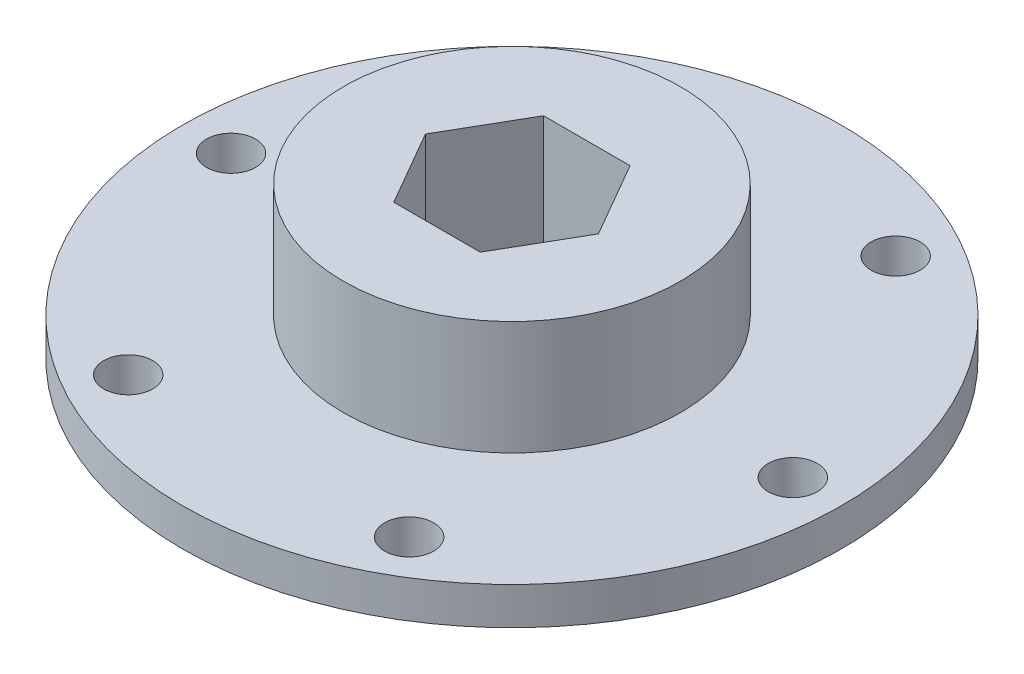
ISO-10303-21;
HEADER;
FILE_DESCRIPTION(('STEP AP214'),'2;1');
FILE_NAME('part.step','',(''),(''),'','','');
FILE_SCHEMA(('AUTOMOTIVE_DESIGN { 1 0 10303 214 1 1 1 1 }'));
ENDSEC;
DATA;
#1=APPLICATION_CONTEXT('core data for automotive mechanical design processes');
#2=APPLICATION_PROTOCOL_DEFINITION('international standard','automotive_design',2000,#1);
#3=PRODUCT_CONTEXT('',#1,'mechanical');
#4=PRODUCT('Part','Part','',(#3));
#5=PRODUCT_RELATED_PRODUCT_CATEGORY('part','',(#4));
#6=PRODUCT_DEFINITION_FORMATION('','',#4);
#7=PRODUCT_DEFINITION_CONTEXT('part definition',#1,'design');
#8=PRODUCT_DEFINITION('design','',#6,#7);
#9=PRODUCT_DEFINITION_SHAPE('','',#8);
#10=(LENGTH_UNIT() NAMED_UNIT(*) SI_UNIT(.MILLI.,.METRE.));
#11=(NAMED_UNIT(*) PLANE_ANGLE_UNIT() SI_UNIT($,.RADIAN.));
#12=(NAMED_UNIT(*) SI_UNIT($,.STERADIAN.) SOLID_ANGLE_UNIT());
#13=UNCERTAINTY_MEASURE_WITH_UNIT(LENGTH_MEASURE(1.E-05),#10,'distance_accuracy_value','');
#14=(GEOMETRIC_REPRESENTATION_CONTEXT(3) GLOBAL_UNCERTAINTY_ASSIGNED_CONTEXT((#13)) GLOBAL_UNIT_ASSIGNED_CONTEXT((#10,
#11,#12)) REPRESENTATION_CONTEXT('',''));
#15=CARTESIAN_POINT('',(0.,0.,0.));
#16=DIRECTION('',(0.,0.,1.));
#17=DIRECTION('',(1.,0.,0.));
#18=AXIS2_PLACEMENT_3D('',#15,#16,#17);
#19=CARTESIAN_POINT('',(0.,3.175,0.));
#20=DIRECTION('',(0.,-1.,0.));
#21=DIRECTION('',(0.,0.,-1.));
#22=AXIS2_PLACEMENT_3D('',#19,#20,#21);
#23=CYLINDRICAL_SURFACE('',#22,27.94);
#24=CARTESIAN_POINT('',(0.,3.175,0.));
#25=DIRECTION('',(0.,1.,0.));
#26=DIRECTION('',(0.,0.,1.));
#27=AXIS2_PLACEMENT_3D('',#24,#25,#26);
#28=CIRCLE('',#27,27.94);
#29=CARTESIAN_POINT('',(0.,3.175,27.94));
#30=VERTEX_POINT('',#29);
#31=EDGE_CURVE('E11',#30,#30,#28,.T.);
#32=ORIENTED_EDGE('',*,*,#31,.F.);
#33=EDGE_LOOP('',(#32));
#34=FACE_BOUND('',#33,.T.);
#35=CARTESIAN_POINT('',(0.,0.,0.));
#36=DIRECTION('',(0.,1.,0.));
#37=DIRECTION('',(0.,0.,1.));
#38=AXIS2_PLACEMENT_3D('',#35,#36,#37);
#39=CIRCLE('',#38,27.94);
#40=CARTESIAN_POINT('',(0.,0.,27.94));
#41=VERTEX_POINT('',#40);
#42=EDGE_CURVE('E37',#41,#41,#39,.T.);
#43=ORIENTED_EDGE('',*,*,#42,.T.);
#44=EDGE_LOOP('',(#43));
#45=FACE_BOUND('',#44,.T.);
#46=ADVANCED_FACE('F34',(#34,#45),#23,.T.);
#47=CARTESIAN_POINT('',(0.,3.175,0.));
#48=DIRECTION('',(0.,1.,0.));
#49=DIRECTION('',(0.,0.,1.));
#50=AXIS2_PLACEMENT_3D('',#47,#48,#49);
#51=PLANE('',#50);
#52=CARTESIAN_POINT('',(-23.8125,3.175,0.));
#53=DIRECTION('',(0.,1.,0.));
#54=DIRECTION('',(0.,0.,1.));
#55=AXIS2_PLACEMENT_3D('',#52,#53,#54);
#56=CIRCLE('',#55,2.0828);
#57=CARTESIAN_POINT('',(-23.8125,3.175,2.0828));
#58=VERTEX_POINT('',#57);
#59=EDGE_CURVE('E222',#58,#58,#56,.T.);
#60=ORIENTED_EDGE('',*,*,#59,.F.);
#61=EDGE_LOOP('',(#60));
#62=FACE_BOUND('',#61,.T.);
#63=CARTESIAN_POINT('',(-11.90625,3.175,-20.6222299276169));
#64=DIRECTION('',(0.,1.,0.));
#65=DIRECTION('',(0.,0.,1.));
#66=AXIS2_PLACEMENT_3D('',#63,#64,#65);
#67=CIRCLE('',#66,2.0828);
#68=CARTESIAN_POINT('',(-11.90625,3.175,-18.5394299276169));
#69=VERTEX_POINT('',#68);
#70=EDGE_CURVE('E231',#69,#69,#67,.T.);
#71=ORIENTED_EDGE('',*,*,#70,.F.);
#72=EDGE_LOOP('',(#71));
#73=FACE_BOUND('',#72,.T.);
#74=CARTESIAN_POINT('',(11.90625,3.175,-20.6222299276169));
#75=DIRECTION('',(0.,1.,0.));
#76=DIRECTION('',(0.,0.,1.));
#77=AXIS2_PLACEMENT_3D('',#74,#75,#76);
#78=CIRCLE('',#77,2.0828);
#79=CARTESIAN_POINT('',(11.90625,3.175,-18.539429927617));
#80=VERTEX_POINT('',#79);
#81=EDGE_CURVE('E237',#80,#80,#78,.T.);
#82=ORIENTED_EDGE('',*,*,#81,.F.);
#83=EDGE_LOOP('',(#82));
#84=FACE_BOUND('',#83,.T.);
#85=CARTESIAN_POINT('',(23.8125,3.175,0.));
#86=DIRECTION('',(0.,1.,0.));
#87=DIRECTION('',(0.,0.,1.));
#88=AXIS2_PLACEMENT_3D('',#85,#86,#87);
#89=CIRCLE('',#88,2.0828);
#90=CARTESIAN_POINT('',(23.8125,3.175,2.08279999999999));
#91=VERTEX_POINT('',#90);
#92=EDGE_CURVE('E243',#91,#91,#89,.T.);
#93=ORIENTED_EDGE('',*,*,#92,.F.);
#94=EDGE_LOOP('',(#93));
#95=FACE_BOUND('',#94,.T.);
#96=CARTESIAN_POINT('',(11.90625,3.175,20.6222299276169));
#97=DIRECTION('',(0.,1.,0.));
#98=DIRECTION('',(0.,0.,1.));
#99=AXIS2_PLACEMENT_3D('',#96,#97,#98);
#100=CIRCLE('',#99,2.0828);
#101=CARTESIAN_POINT('',(11.90625,3.175,22.7050299276169));
#102=VERTEX_POINT('',#101);
#103=EDGE_CURVE('E249',#102,#102,#100,.T.);
#104=ORIENTED_EDGE('',*,*,#103,.F.);
#105=EDGE_LOOP('',(#104));
#106=FACE_BOUND('',#105,.T.);
#107=CARTESIAN_POINT('',(-11.90625,3.175,20.622229927617));
#108=DIRECTION('',(0.,1.,0.));
#109=DIRECTION('',(0.,0.,1.));
#110=AXIS2_PLACEMENT_3D('',#107,#108,#109);
#111=CIRCLE('',#110,2.0828);
#112=CARTESIAN_POINT('',(-11.90625,3.175,22.705029927617));
#113=VERTEX_POINT('',#112);
#114=EDGE_CURVE('E111',#113,#113,#111,.T.);
#115=ORIENTED_EDGE('',*,*,#114,.F.);
#116=EDGE_LOOP('',(#115));
#117=FACE_BOUND('',#116,.T.);
#118=CARTESIAN_POINT('',(0.,3.175,0.));
#119=DIRECTION('',(0.,1.,0.));
#120=DIRECTION('',(0.,0.,1.));
#121=AXIS2_PLACEMENT_3D('',#118,#119,#120);
#122=CIRCLE('',#121,14.2875);
#123=CARTESIAN_POINT('',(0.,3.175,14.2875));
#124=VERTEX_POINT('',#123);
#125=EDGE_CURVE('E134',#124,#124,#122,.T.);
#126=ORIENTED_EDGE('',*,*,#125,.F.);
#127=EDGE_LOOP('',(#126));
#128=FACE_BOUND('',#127,.T.);
#129=ORIENTED_EDGE('',*,*,#31,.T.);
#130=EDGE_LOOP('',(#129));
#131=FACE_BOUND('',#130,.T.);
#132=ADVANCED_FACE('F150',(#62,#73,#84,#95,#106,#117,#128,#131),#51,.T.);
#133=CARTESIAN_POINT('',(0.,0.,0.));
#134=DIRECTION('',(0.,1.,0.));
#135=DIRECTION('',(0.,0.,1.));
#136=AXIS2_PLACEMENT_3D('',#133,#134,#135);
#137=PLANE('',#136);
#138=CARTESIAN_POINT('',(-23.8125,0.,0.));
#139=DIRECTION('',(0.,-1.,0.));
#140=DIRECTION('',(0.,0.,-1.));
#141=AXIS2_PLACEMENT_3D('',#138,#139,#140);
#142=CIRCLE('',#141,2.0828);
#143=CARTESIAN_POINT('',(-23.8125,0.,-2.0828));
#144=VERTEX_POINT('',#143);
#145=EDGE_CURVE('E224',#144,#144,#142,.T.);
#146=ORIENTED_EDGE('',*,*,#145,.F.);
#147=EDGE_LOOP('',(#146));
#148=FACE_BOUND('',#147,.T.);
#149=CARTESIAN_POINT('',(-11.90625,0.,-20.6222299276169));
#150=DIRECTION('',(0.,-1.,0.));
#151=DIRECTION('',(0.,0.,-1.));
#152=AXIS2_PLACEMENT_3D('',#149,#150,#151);
#153=CIRCLE('',#152,2.0828);
#154=CARTESIAN_POINT('',(-11.90625,0.,-22.7050299276169));
#155=VERTEX_POINT('',#154);
#156=EDGE_CURVE('E226',#155,#155,#153,.T.);
#157=ORIENTED_EDGE('',*,*,#156,.F.);
#158=EDGE_LOOP('',(#157));
#159=FACE_BOUND('',#158,.T.);
#160=CARTESIAN_POINT('',(11.90625,0.,-20.6222299276169));
#161=DIRECTION('',(0.,-1.,0.));
#162=DIRECTION('',(0.,0.,-1.));
#163=AXIS2_PLACEMENT_3D('',#160,#161,#162);
#164=CIRCLE('',#163,2.0828);
#165=CARTESIAN_POINT('',(11.90625,0.,-22.705029927617));
#166=VERTEX_POINT('',#165);
#167=EDGE_CURVE('E234',#166,#166,#164,.T.);
#168=ORIENTED_EDGE('',*,*,#167,.F.);
#169=EDGE_LOOP('',(#168));
#170=FACE_BOUND('',#169,.T.);
#171=CARTESIAN_POINT('',(23.8125,0.,0.));
#172=DIRECTION('',(0.,-1.,0.));
#173=DIRECTION('',(0.,0.,-1.));
#174=AXIS2_PLACEMENT_3D('',#171,#172,#173);
#175=CIRCLE('',#174,2.0828);
#176=CARTESIAN_POINT('',(23.8125,0.,-2.08280000000001));
#177=VERTEX_POINT('',#176);
#178=EDGE_CURVE('E240',#177,#177,#175,.T.);
#179=ORIENTED_EDGE('',*,*,#178,.F.);
#180=EDGE_LOOP('',(#179));
#181=FACE_BOUND('',#180,.T.);
#182=CARTESIAN_POINT('',(11.90625,0.,20.6222299276169));
#183=DIRECTION('',(0.,-1.,0.));
#184=DIRECTION('',(0.,0.,-1.));
#185=AXIS2_PLACEMENT_3D('',#182,#183,#184);
#186=CIRCLE('',#185,2.0828);
#187=CARTESIAN_POINT('',(11.90625,0.,18.5394299276169));
#188=VERTEX_POINT('',#187);
#189=EDGE_CURVE('E246',#188,#188,#186,.T.);
#190=ORIENTED_EDGE('',*,*,#189,.F.);
#191=EDGE_LOOP('',(#190));
#192=FACE_BOUND('',#191,.T.);
#193=CARTESIAN_POINT('',(-11.90625,0.,20.622229927617));
#194=DIRECTION('',(0.,-1.,0.));
#195=DIRECTION('',(0.,0.,-1.));
#196=AXIS2_PLACEMENT_3D('',#193,#194,#195);
#197=CIRCLE('',#196,2.0828);
#198=CARTESIAN_POINT('',(-11.90625,0.,18.539429927617));
#199=VERTEX_POINT('',#198);
#200=EDGE_CURVE('E251',#199,#199,#197,.T.);
#201=ORIENTED_EDGE('',*,*,#200,.F.);
#202=EDGE_LOOP('',(#201));
#203=FACE_BOUND('',#202,.T.);
#204=DIRECTION('',(0.5,0.,0.866025403784439));
#205=VECTOR('',#204,1.);
#206=CARTESIAN_POINT('',(3.66617420935412,0.,-6.35));
#207=LINE('',#206,#205);
#208=CARTESIAN_POINT('',(3.66617420935412,0.,-6.35));
#209=VERTEX_POINT('',#208);
#210=CARTESIAN_POINT('',(7.33234841870825,0.,0.));
#211=VERTEX_POINT('',#210);
#212=EDGE_CURVE('E122',#209,#211,#207,.T.);
#213=ORIENTED_EDGE('',*,*,#212,.F.);
#214=DIRECTION('',(1.,0.,0.));
#215=VECTOR('',#214,1.);
#216=CARTESIAN_POINT('',(-3.66617420935413,0.,-6.35));
#217=LINE('',#216,#215);
#218=CARTESIAN_POINT('',(-3.66617420935413,0.,-6.35));
#219=VERTEX_POINT('',#218);
#220=EDGE_CURVE('E48',#219,#209,#217,.T.);
#221=ORIENTED_EDGE('',*,*,#220,.F.);
#222=DIRECTION('',(0.5,0.,-0.866025403784439));
#223=VECTOR('',#222,1.);
#224=CARTESIAN_POINT('',(-7.33234841870825,0.,0.));
#225=LINE('',#224,#223);
#226=CARTESIAN_POINT('',(-7.33234841870825,0.,0.));
#227=VERTEX_POINT('',#226);
#228=EDGE_CURVE('E105',#227,#219,#225,.T.);
#229=ORIENTED_EDGE('',*,*,#228,.F.);
#230=DIRECTION('',(-0.5,0.,-0.866025403784438));
#231=VECTOR('',#230,1.);
#232=CARTESIAN_POINT('',(-3.66617420935412,0.,6.35));
#233=LINE('',#232,#231);
#234=CARTESIAN_POINT('',(-3.66617420935412,0.,6.35));
#235=VERTEX_POINT('',#234);
#236=EDGE_CURVE('E108',#235,#227,#233,.T.);
#237=ORIENTED_EDGE('',*,*,#236,.F.);
#238=DIRECTION('',(-1.,0.,0.));
#239=VECTOR('',#238,1.);
#240=CARTESIAN_POINT('',(3.66617420935413,0.,6.35));
#241=LINE('',#240,#239);
#242=CARTESIAN_POINT('',(3.66617420935413,0.,6.35));
#243=VERTEX_POINT('',#242);
#244=EDGE_CURVE('E127',#243,#235,#241,.T.);
#245=ORIENTED_EDGE('',*,*,#244,.F.);
#246=DIRECTION('',(-0.5,0.,0.866025403784439));
#247=VECTOR('',#246,1.);
#248=CARTESIAN_POINT('',(7.33234841870825,0.,0.));
#249=LINE('',#248,#247);
#250=EDGE_CURVE('E124',#211,#243,#249,.T.);
#251=ORIENTED_EDGE('',*,*,#250,.F.);
#252=EDGE_LOOP('',(#213,#221,#229,#237,#245,#251));
#253=FACE_BOUND('',#252,.T.);
#254=ORIENTED_EDGE('',*,*,#42,.F.);
#255=EDGE_LOOP('',(#254));
#256=FACE_BOUND('',#255,.T.);
#257=ADVANCED_FACE('F153',(#148,#159,#170,#181,#192,#203,#253,#256),#137,.F.);
#258=CARTESIAN_POINT('',(0.,12.827,0.));
#259=DIRECTION('',(0.,-1.,0.));
#260=DIRECTION('',(0.,0.,-1.));
#261=AXIS2_PLACEMENT_3D('',#258,#259,#260);
#262=CYLINDRICAL_SURFACE('',#261,14.2875);
#263=CARTESIAN_POINT('',(0.,12.827,0.));
#264=DIRECTION('',(0.,1.,0.));
#265=DIRECTION('',(0.,0.,1.));
#266=AXIS2_PLACEMENT_3D('',#263,#264,#265);
#267=CIRCLE('',#266,14.2875);
#268=CARTESIAN_POINT('',(0.,12.827,14.2875));
#269=VERTEX_POINT('',#268);
#270=EDGE_CURVE('E142',#269,#269,#267,.T.);
#271=ORIENTED_EDGE('',*,*,#270,.F.);
#272=EDGE_LOOP('',(#271));
#273=FACE_BOUND('',#272,.T.);
#274=ORIENTED_EDGE('',*,*,#125,.T.);
#275=EDGE_LOOP('',(#274));
#276=FACE_BOUND('',#275,.T.);
#277=ADVANCED_FACE('F148',(#273,#276),#262,.T.);
#278=CARTESIAN_POINT('',(0.,12.827,0.));
#279=DIRECTION('',(0.,1.,0.));
#280=DIRECTION('',(0.,0.,1.));
#281=AXIS2_PLACEMENT_3D('',#278,#279,#280);
#282=PLANE('',#281);
#283=DIRECTION('',(1.,0.,0.));
#284=VECTOR('',#283,1.);
#285=CARTESIAN_POINT('',(-3.66617420935413,12.827,-6.35));
#286=LINE('',#285,#284);
#287=CARTESIAN_POINT('',(-3.66617420935413,12.827,-6.35));
#288=VERTEX_POINT('',#287);
#289=CARTESIAN_POINT('',(3.66617420935412,12.827,-6.35));
#290=VERTEX_POINT('',#289);
#291=EDGE_CURVE('E88',#288,#290,#286,.T.);
#292=ORIENTED_EDGE('',*,*,#291,.T.);
#293=DIRECTION('',(0.5,0.,0.866025403784439));
#294=VECTOR('',#293,1.);
#295=CARTESIAN_POINT('',(3.66617420935412,12.827,-6.35));
#296=LINE('',#295,#294);
#297=CARTESIAN_POINT('',(7.33234841870825,12.827,0.));
#298=VERTEX_POINT('',#297);
#299=EDGE_CURVE('E97',#290,#298,#296,.T.);
#300=ORIENTED_EDGE('',*,*,#299,.T.);
#301=DIRECTION('',(-0.5,0.,0.866025403784439));
#302=VECTOR('',#301,1.);
#303=CARTESIAN_POINT('',(7.33234841870825,12.827,0.));
#304=LINE('',#303,#302);
#305=CARTESIAN_POINT('',(3.66617420935413,12.827,6.35));
#306=VERTEX_POINT('',#305);
#307=EDGE_CURVE('E56',#298,#306,#304,.T.);
#308=ORIENTED_EDGE('',*,*,#307,.T.);
#309=DIRECTION('',(-1.,0.,0.));
#310=VECTOR('',#309,1.);
#311=CARTESIAN_POINT('',(3.66617420935413,12.827,6.35));
#312=LINE('',#311,#310);
#313=CARTESIAN_POINT('',(-3.66617420935412,12.827,6.35));
#314=VERTEX_POINT('',#313);
#315=EDGE_CURVE('E115',#306,#314,#312,.T.);
#316=ORIENTED_EDGE('',*,*,#315,.T.);
#317=DIRECTION('',(-0.5,0.,-0.866025403784438));
#318=VECTOR('',#317,1.);
#319=CARTESIAN_POINT('',(-3.66617420935412,12.827,6.35));
#320=LINE('',#319,#318);
#321=CARTESIAN_POINT('',(-7.33234841870825,12.827,0.));
#322=VERTEX_POINT('',#321);
#323=EDGE_CURVE('E118',#314,#322,#320,.T.);
#324=ORIENTED_EDGE('',*,*,#323,.T.);
#325=DIRECTION('',(0.5,0.,-0.866025403784439));
#326=VECTOR('',#325,1.);
#327=CARTESIAN_POINT('',(-7.33234841870825,12.827,0.));
#328=LINE('',#327,#326);
#329=EDGE_CURVE('E94',#322,#288,#328,.T.);
#330=ORIENTED_EDGE('',*,*,#329,.T.);
#331=EDGE_LOOP('',(#292,#300,#308,#316,#324,#330));
#332=FACE_BOUND('',#331,.T.);
#333=ORIENTED_EDGE('',*,*,#270,.T.);
#334=EDGE_LOOP('',(#333));
#335=FACE_BOUND('',#334,.T.);
#336=ADVANCED_FACE('F101',(#332,#335),#282,.T.);
#337=CARTESIAN_POINT('',(-3.66617420935413,12.827,-6.35));
#338=DIRECTION('',(0.,0.,-1.));
#339=DIRECTION('',(-1.,0.,0.));
#340=AXIS2_PLACEMENT_3D('',#337,#338,#339);
#341=PLANE('',#340);
#342=ORIENTED_EDGE('',*,*,#220,.T.);
#343=DIRECTION('',(0.,-1.,0.));
#344=VECTOR('',#343,1.);
#345=CARTESIAN_POINT('',(3.66617420935412,12.827,-6.35));
#346=LINE('',#345,#344);
#347=EDGE_CURVE('E84',#290,#209,#346,.T.);
#348=ORIENTED_EDGE('',*,*,#347,.F.);
#349=ORIENTED_EDGE('',*,*,#291,.F.);
#350=DIRECTION('',(0.,-1.,0.));
#351=VECTOR('',#350,1.);
#352=CARTESIAN_POINT('',(-3.66617420935413,12.827,-6.35));
#353=LINE('',#352,#351);
#354=EDGE_CURVE('E132',#288,#219,#353,.T.);
#355=ORIENTED_EDGE('',*,*,#354,.T.);
#356=EDGE_LOOP('',(#342,#348,#349,#355));
#357=FACE_BOUND('',#356,.T.);
#358=ADVANCED_FACE('F86',(#357),#341,.F.);
#359=CARTESIAN_POINT('',(-7.33234841870825,12.827,0.));
#360=DIRECTION('',(-0.866025403784439,0.,-0.5));
#361=DIRECTION('',(-0.5,0.,0.866025403784439));
#362=AXIS2_PLACEMENT_3D('',#359,#360,#361);
#363=PLANE('',#362);
#364=ORIENTED_EDGE('',*,*,#228,.T.);
#365=ORIENTED_EDGE('',*,*,#354,.F.);
#366=ORIENTED_EDGE('',*,*,#329,.F.);
#367=DIRECTION('',(0.,-1.,0.));
#368=VECTOR('',#367,1.);
#369=CARTESIAN_POINT('',(-7.33234841870825,12.827,0.));
#370=LINE('',#369,#368);
#371=EDGE_CURVE('E135',#322,#227,#370,.T.);
#372=ORIENTED_EDGE('',*,*,#371,.T.);
#373=EDGE_LOOP('',(#364,#365,#366,#372));
#374=FACE_BOUND('',#373,.T.);
#375=ADVANCED_FACE('F177',(#374),#363,.F.);
#376=CARTESIAN_POINT('',(-3.66617420935412,12.827,6.35));
#377=DIRECTION('',(-0.866025403784438,0.,0.5));
#378=DIRECTION('',(0.5,0.,0.866025403784439));
#379=AXIS2_PLACEMENT_3D('',#376,#377,#378);
#380=PLANE('',#379);
#381=ORIENTED_EDGE('',*,*,#236,.T.);
#382=ORIENTED_EDGE('',*,*,#371,.F.);
#383=ORIENTED_EDGE('',*,*,#323,.F.);
#384=DIRECTION('',(0.,-1.,0.));
#385=VECTOR('',#384,1.);
#386=CARTESIAN_POINT('',(-3.66617420935412,12.827,6.35));
#387=LINE('',#386,#385);
#388=EDGE_CURVE('E137',#314,#235,#387,.T.);
#389=ORIENTED_EDGE('',*,*,#388,.T.);
#390=EDGE_LOOP('',(#381,#382,#383,#389));
#391=FACE_BOUND('',#390,.T.);
#392=ADVANCED_FACE('F187',(#391),#380,.F.);
#393=CARTESIAN_POINT('',(3.66617420935413,12.827,6.35));
#394=DIRECTION('',(0.,0.,1.));
#395=DIRECTION('',(1.,0.,0.));
#396=AXIS2_PLACEMENT_3D('',#393,#394,#395);
#397=PLANE('',#396);
#398=ORIENTED_EDGE('',*,*,#244,.T.);
#399=ORIENTED_EDGE('',*,*,#388,.F.);
#400=ORIENTED_EDGE('',*,*,#315,.F.);
#401=DIRECTION('',(0.,-1.,0.));
#402=VECTOR('',#401,1.);
#403=CARTESIAN_POINT('',(3.66617420935413,12.827,6.35));
#404=LINE('',#403,#402);
#405=EDGE_CURVE('E139',#306,#243,#404,.T.);
#406=ORIENTED_EDGE('',*,*,#405,.T.);
#407=EDGE_LOOP('',(#398,#399,#400,#406));
#408=FACE_BOUND('',#407,.T.);
#409=ADVANCED_FACE('F184',(#408),#397,.F.);
#410=CARTESIAN_POINT('',(7.33234841870825,12.827,0.));
#411=DIRECTION('',(0.866025403784439,0.,0.5));
#412=DIRECTION('',(0.5,0.,-0.866025403784439));
#413=AXIS2_PLACEMENT_3D('',#410,#411,#412);
#414=PLANE('',#413);
#415=ORIENTED_EDGE('',*,*,#250,.T.);
#416=ORIENTED_EDGE('',*,*,#405,.F.);
#417=ORIENTED_EDGE('',*,*,#307,.F.);
#418=DIRECTION('',(0.,-1.,0.));
#419=VECTOR('',#418,1.);
#420=CARTESIAN_POINT('',(7.33234841870825,12.827,0.));
#421=LINE('',#420,#419);
#422=EDGE_CURVE('E93',#298,#211,#421,.T.);
#423=ORIENTED_EDGE('',*,*,#422,.T.);
#424=EDGE_LOOP('',(#415,#416,#417,#423));
#425=FACE_BOUND('',#424,.T.);
#426=ADVANCED_FACE('F181',(#425),#414,.F.);
#427=CARTESIAN_POINT('',(3.66617420935412,12.827,-6.35));
#428=DIRECTION('',(0.866025403784439,0.,-0.5));
#429=DIRECTION('',(-0.5,0.,-0.866025403784439));
#430=AXIS2_PLACEMENT_3D('',#427,#428,#429);
#431=PLANE('',#430);
#432=ORIENTED_EDGE('',*,*,#212,.T.);
#433=ORIENTED_EDGE('',*,*,#422,.F.);
#434=ORIENTED_EDGE('',*,*,#299,.F.);
#435=ORIENTED_EDGE('',*,*,#347,.T.);
#436=EDGE_LOOP('',(#432,#433,#434,#435));
#437=FACE_BOUND('',#436,.T.);
#438=ADVANCED_FACE('F98',(#437),#431,.F.);
#439=CARTESIAN_POINT('',(-11.90625,12.827,20.622229927617));
#440=DIRECTION('',(0.,-1.,0.));
#441=DIRECTION('',(0.,0.,-1.));
#442=AXIS2_PLACEMENT_3D('',#439,#440,#441);
#443=CYLINDRICAL_SURFACE('',#442,2.0828);
#444=ORIENTED_EDGE('',*,*,#114,.T.);
#445=EDGE_LOOP('',(#444));
#446=FACE_BOUND('',#445,.T.);
#447=ORIENTED_EDGE('',*,*,#200,.T.);
#448=EDGE_LOOP('',(#447));
#449=FACE_BOUND('',#448,.T.);
#450=ADVANCED_FACE('F180',(#446,#449),#443,.F.);
#451=CARTESIAN_POINT('',(11.90625,12.827,20.6222299276169));
#452=DIRECTION('',(0.,-1.,0.));
#453=DIRECTION('',(0.,0.,-1.));
#454=AXIS2_PLACEMENT_3D('',#451,#452,#453);
#455=CYLINDRICAL_SURFACE('',#454,2.0828);
#456=ORIENTED_EDGE('',*,*,#103,.T.);
#457=EDGE_LOOP('',(#456));
#458=FACE_BOUND('',#457,.T.);
#459=ORIENTED_EDGE('',*,*,#189,.T.);
#460=EDGE_LOOP('',(#459));
#461=FACE_BOUND('',#460,.T.);
#462=ADVANCED_FACE('F197',(#458,#461),#455,.F.);
#463=CARTESIAN_POINT('',(23.8125,12.827,0.));
#464=DIRECTION('',(0.,-1.,0.));
#465=DIRECTION('',(0.,0.,-1.));
#466=AXIS2_PLACEMENT_3D('',#463,#464,#465);
#467=CYLINDRICAL_SURFACE('',#466,2.0828);
#468=ORIENTED_EDGE('',*,*,#92,.T.);
#469=EDGE_LOOP('',(#468));
#470=FACE_BOUND('',#469,.T.);
#471=ORIENTED_EDGE('',*,*,#178,.T.);
#472=EDGE_LOOP('',(#471));
#473=FACE_BOUND('',#472,.T.);
#474=ADVANCED_FACE('F201',(#470,#473),#467,.F.);
#475=CARTESIAN_POINT('',(11.90625,12.827,-20.6222299276169));
#476=DIRECTION('',(0.,-1.,0.));
#477=DIRECTION('',(0.,0.,-1.));
#478=AXIS2_PLACEMENT_3D('',#475,#476,#477);
#479=CYLINDRICAL_SURFACE('',#478,2.0828);
#480=ORIENTED_EDGE('',*,*,#81,.T.);
#481=EDGE_LOOP('',(#480));
#482=FACE_BOUND('',#481,.T.);
#483=ORIENTED_EDGE('',*,*,#167,.T.);
#484=EDGE_LOOP('',(#483));
#485=FACE_BOUND('',#484,.T.);
#486=ADVANCED_FACE('F205',(#482,#485),#479,.F.);
#487=CARTESIAN_POINT('',(-11.90625,12.827,-20.6222299276169));
#488=DIRECTION('',(0.,-1.,0.));
#489=DIRECTION('',(0.,0.,-1.));
#490=AXIS2_PLACEMENT_3D('',#487,#488,#489);
#491=CYLINDRICAL_SURFACE('',#490,2.0828);
#492=ORIENTED_EDGE('',*,*,#70,.T.);
#493=EDGE_LOOP('',(#492));
#494=FACE_BOUND('',#493,.T.);
#495=ORIENTED_EDGE('',*,*,#156,.T.);
#496=EDGE_LOOP('',(#495));
#497=FACE_BOUND('',#496,.T.);
#498=ADVANCED_FACE('F209',(#494,#497),#491,.F.);
#499=CARTESIAN_POINT('',(-23.8125,12.827,0.));
#500=DIRECTION('',(0.,-1.,0.));
#501=DIRECTION('',(0.,0.,-1.));
#502=AXIS2_PLACEMENT_3D('',#499,#500,#501);
#503=CYLINDRICAL_SURFACE('',#502,2.0828);
#504=ORIENTED_EDGE('',*,*,#59,.T.);
#505=EDGE_LOOP('',(#504));
#506=FACE_BOUND('',#505,.T.);
#507=ORIENTED_EDGE('',*,*,#145,.T.);
#508=EDGE_LOOP('',(#507));
#509=FACE_BOUND('',#508,.T.);
#510=ADVANCED_FACE('F213',(#506,#509),#503,.F.);
#511=CLOSED_SHELL('',(#46,#132,#257,#277,#336,#358,#375,#392,#409,#426,#438,#450,#462,#474,#486,
#498,#510));
#512=MANIFOLD_SOLID_BREP('B2',#511);
#513=ADVANCED_BREP_SHAPE_REPRESENTATION('',(#18,#512),#14);
#514=SHAPE_DEFINITION_REPRESENTATION(#9,#513);
ENDSEC;
END-ISO-10303-21;
